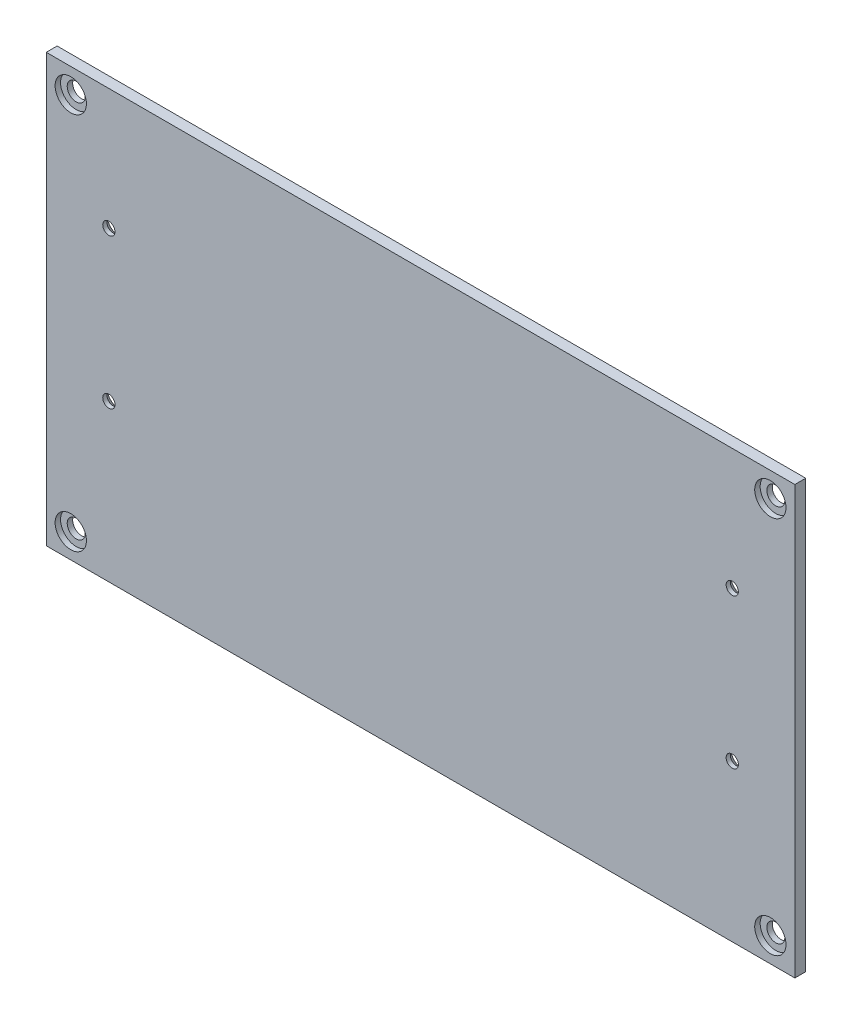
ISO-10303-21;
HEADER;
FILE_DESCRIPTION(('STEP AP214'),'2;1');
FILE_NAME('part.step','',(''),(''),'','','');
FILE_SCHEMA(('AUTOMOTIVE_DESIGN { 1 0 10303 214 1 1 1 1 }'));
ENDSEC;
DATA;
#1=APPLICATION_CONTEXT('core data for automotive mechanical design processes');
#2=APPLICATION_PROTOCOL_DEFINITION('international standard','automotive_design',2000,#1);
#3=PRODUCT_CONTEXT('',#1,'mechanical');
#4=PRODUCT('Part','Part','',(#3));
#5=PRODUCT_RELATED_PRODUCT_CATEGORY('part','',(#4));
#6=PRODUCT_DEFINITION_FORMATION('','',#4);
#7=PRODUCT_DEFINITION_CONTEXT('part definition',#1,'design');
#8=PRODUCT_DEFINITION('design','',#6,#7);
#9=PRODUCT_DEFINITION_SHAPE('','',#8);
#10=(LENGTH_UNIT() NAMED_UNIT(*) SI_UNIT(.MILLI.,.METRE.));
#11=(NAMED_UNIT(*) PLANE_ANGLE_UNIT() SI_UNIT($,.RADIAN.));
#12=(NAMED_UNIT(*) SI_UNIT($,.STERADIAN.) SOLID_ANGLE_UNIT());
#13=UNCERTAINTY_MEASURE_WITH_UNIT(LENGTH_MEASURE(1.E-05),#10,'distance_accuracy_value','');
#14=(GEOMETRIC_REPRESENTATION_CONTEXT(3) GLOBAL_UNCERTAINTY_ASSIGNED_CONTEXT((#13)) GLOBAL_UNIT_ASSIGNED_CONTEXT((#10,
#11,#12)) REPRESENTATION_CONTEXT('',''));
#15=CARTESIAN_POINT('',(0.,0.,0.));
#16=DIRECTION('',(0.,0.,1.));
#17=DIRECTION('',(1.,0.,0.));
#18=AXIS2_PLACEMENT_3D('',#15,#16,#17);
#19=CARTESIAN_POINT('',(-137.5,78.5,4.));
#20=DIRECTION('',(0.,-1.,0.));
#21=DIRECTION('',(0.,0.,-1.));
#22=AXIS2_PLACEMENT_3D('',#19,#20,#21);
#23=PLANE('',#22);
#24=DIRECTION('',(-1.,0.,0.));
#25=VECTOR('',#24,1.);
#26=CARTESIAN_POINT('',(-137.5,78.5,0.));
#27=LINE('',#26,#25);
#28=CARTESIAN_POINT('',(137.5,78.5,0.));
#29=VERTEX_POINT('',#28);
#30=CARTESIAN_POINT('',(-137.5,78.5,0.));
#31=VERTEX_POINT('',#30);
#32=EDGE_CURVE('E102',#29,#31,#27,.T.);
#33=ORIENTED_EDGE('',*,*,#32,.T.);
#34=DIRECTION('',(0.,0.,-1.));
#35=VECTOR('',#34,1.);
#36=CARTESIAN_POINT('',(-137.5,78.5,4.));
#37=LINE('',#36,#35);
#38=CARTESIAN_POINT('',(-137.5,78.5,4.));
#39=VERTEX_POINT('',#38);
#40=EDGE_CURVE('E11',#39,#31,#37,.T.);
#41=ORIENTED_EDGE('',*,*,#40,.F.);
#42=DIRECTION('',(-1.,0.,0.));
#43=VECTOR('',#42,1.);
#44=CARTESIAN_POINT('',(-137.5,78.5,4.));
#45=LINE('',#44,#43);
#46=CARTESIAN_POINT('',(137.5,78.5,4.));
#47=VERTEX_POINT('',#46);
#48=EDGE_CURVE('E90',#47,#39,#45,.T.);
#49=ORIENTED_EDGE('',*,*,#48,.F.);
#50=DIRECTION('',(0.,0.,-1.));
#51=VECTOR('',#50,1.);
#52=CARTESIAN_POINT('',(137.5,78.5,4.));
#53=LINE('',#52,#51);
#54=EDGE_CURVE('E98',#47,#29,#53,.T.);
#55=ORIENTED_EDGE('',*,*,#54,.T.);
#56=EDGE_LOOP('',(#33,#41,#49,#55));
#57=FACE_BOUND('',#56,.T.);
#58=ADVANCED_FACE('F39',(#57),#23,.F.);
#59=CARTESIAN_POINT('',(-137.5,78.5,4.));
#60=DIRECTION('',(1.,0.,0.));
#61=DIRECTION('',(0.,0.,-1.));
#62=AXIS2_PLACEMENT_3D('',#59,#60,#61);
#63=PLANE('',#62);
#64=DIRECTION('',(0.,-1.,0.));
#65=VECTOR('',#64,1.);
#66=CARTESIAN_POINT('',(-137.5,78.5,0.));
#67=LINE('',#66,#65);
#68=CARTESIAN_POINT('',(-137.5,-78.5,0.));
#69=VERTEX_POINT('',#68);
#70=EDGE_CURVE('E94',#31,#69,#67,.T.);
#71=ORIENTED_EDGE('',*,*,#70,.T.);
#72=DIRECTION('',(0.,0.,-1.));
#73=VECTOR('',#72,1.);
#74=CARTESIAN_POINT('',(-137.5,-78.5,4.));
#75=LINE('',#74,#73);
#76=CARTESIAN_POINT('',(-137.5,-78.5,4.));
#77=VERTEX_POINT('',#76);
#78=EDGE_CURVE('E47',#77,#69,#75,.T.);
#79=ORIENTED_EDGE('',*,*,#78,.F.);
#80=DIRECTION('',(0.,-1.,0.));
#81=VECTOR('',#80,1.);
#82=CARTESIAN_POINT('',(-137.5,78.5,4.));
#83=LINE('',#82,#81);
#84=EDGE_CURVE('E85',#39,#77,#83,.T.);
#85=ORIENTED_EDGE('',*,*,#84,.F.);
#86=ORIENTED_EDGE('',*,*,#40,.T.);
#87=EDGE_LOOP('',(#71,#79,#85,#86));
#88=FACE_BOUND('',#87,.T.);
#89=ADVANCED_FACE('F93',(#88),#63,.F.);
#90=CARTESIAN_POINT('',(-137.5,-78.5,4.));
#91=DIRECTION('',(0.,1.,0.));
#92=DIRECTION('',(0.,0.,1.));
#93=AXIS2_PLACEMENT_3D('',#90,#91,#92);
#94=PLANE('',#93);
#95=DIRECTION('',(1.,0.,0.));
#96=VECTOR('',#95,1.);
#97=CARTESIAN_POINT('',(-137.5,-78.5,0.));
#98=LINE('',#97,#96);
#99=CARTESIAN_POINT('',(137.5,-78.5,0.));
#100=VERTEX_POINT('',#99);
#101=EDGE_CURVE('E72',#69,#100,#98,.T.);
#102=ORIENTED_EDGE('',*,*,#101,.T.);
#103=DIRECTION('',(0.,0.,-1.));
#104=VECTOR('',#103,1.);
#105=CARTESIAN_POINT('',(137.5,-78.5,4.));
#106=LINE('',#105,#104);
#107=CARTESIAN_POINT('',(137.5,-78.5,4.));
#108=VERTEX_POINT('',#107);
#109=EDGE_CURVE('E95',#108,#100,#106,.T.);
#110=ORIENTED_EDGE('',*,*,#109,.F.);
#111=DIRECTION('',(1.,0.,0.));
#112=VECTOR('',#111,1.);
#113=CARTESIAN_POINT('',(-137.5,-78.5,4.));
#114=LINE('',#113,#112);
#115=EDGE_CURVE('E88',#77,#108,#114,.T.);
#116=ORIENTED_EDGE('',*,*,#115,.F.);
#117=ORIENTED_EDGE('',*,*,#78,.T.);
#118=EDGE_LOOP('',(#102,#110,#116,#117));
#119=FACE_BOUND('',#118,.T.);
#120=ADVANCED_FACE('F96',(#119),#94,.F.);
#121=CARTESIAN_POINT('',(137.5,78.5,4.));
#122=DIRECTION('',(-1.,0.,0.));
#123=DIRECTION('',(0.,0.,1.));
#124=AXIS2_PLACEMENT_3D('',#121,#122,#123);
#125=PLANE('',#124);
#126=DIRECTION('',(0.,1.,0.));
#127=VECTOR('',#126,1.);
#128=CARTESIAN_POINT('',(137.5,78.5,0.));
#129=LINE('',#128,#127);
#130=EDGE_CURVE('E78',#100,#29,#129,.T.);
#131=ORIENTED_EDGE('',*,*,#130,.T.);
#132=ORIENTED_EDGE('',*,*,#54,.F.);
#133=DIRECTION('',(0.,1.,0.));
#134=VECTOR('',#133,1.);
#135=CARTESIAN_POINT('',(137.5,78.5,4.));
#136=LINE('',#135,#134);
#137=EDGE_CURVE('E55',#108,#47,#136,.T.);
#138=ORIENTED_EDGE('',*,*,#137,.F.);
#139=ORIENTED_EDGE('',*,*,#109,.T.);
#140=EDGE_LOOP('',(#131,#132,#138,#139));
#141=FACE_BOUND('',#140,.T.);
#142=ADVANCED_FACE('F110',(#141),#125,.F.);
#143=CARTESIAN_POINT('',(0.,0.,4.));
#144=DIRECTION('',(0.,0.,-1.));
#145=DIRECTION('',(-1.,0.,0.));
#146=AXIS2_PLACEMENT_3D('',#143,#144,#145);
#147=PLANE('',#146);
#148=CARTESIAN_POINT('',(-128.5,-69.5,4.));
#149=DIRECTION('',(0.,0.,1.));
#150=DIRECTION('',(1.,0.,0.));
#151=AXIS2_PLACEMENT_3D('',#148,#149,#150);
#152=CIRCLE('',#151,5.75000000000001);
#153=CARTESIAN_POINT('',(-122.75,-69.5,4.));
#154=VERTEX_POINT('',#153);
#155=EDGE_CURVE('E196',#154,#154,#152,.T.);
#156=ORIENTED_EDGE('',*,*,#155,.F.);
#157=EDGE_LOOP('',(#156));
#158=FACE_BOUND('',#157,.T.);
#159=CARTESIAN_POINT('',(-128.5,69.5,4.));
#160=DIRECTION('',(0.,0.,1.));
#161=DIRECTION('',(1.,0.,0.));
#162=AXIS2_PLACEMENT_3D('',#159,#160,#161);
#163=CIRCLE('',#162,5.75000000000001);
#164=CARTESIAN_POINT('',(-122.75,69.5,4.));
#165=VERTEX_POINT('',#164);
#166=EDGE_CURVE('E184',#165,#165,#163,.T.);
#167=ORIENTED_EDGE('',*,*,#166,.F.);
#168=EDGE_LOOP('',(#167));
#169=FACE_BOUND('',#168,.T.);
#170=CARTESIAN_POINT('',(128.5,69.5,4.));
#171=DIRECTION('',(0.,0.,1.));
#172=DIRECTION('',(1.,0.,0.));
#173=AXIS2_PLACEMENT_3D('',#170,#171,#172);
#174=CIRCLE('',#173,5.75000000000001);
#175=CARTESIAN_POINT('',(134.25,69.5,4.));
#176=VERTEX_POINT('',#175);
#177=EDGE_CURVE('E172',#176,#176,#174,.T.);
#178=ORIENTED_EDGE('',*,*,#177,.F.);
#179=EDGE_LOOP('',(#178));
#180=FACE_BOUND('',#179,.T.);
#181=CARTESIAN_POINT('',(128.5,-69.5,4.));
#182=DIRECTION('',(0.,0.,1.));
#183=DIRECTION('',(1.,0.,0.));
#184=AXIS2_PLACEMENT_3D('',#181,#182,#183);
#185=CIRCLE('',#184,5.75000000000001);
#186=CARTESIAN_POINT('',(134.25,-69.5,4.));
#187=VERTEX_POINT('',#186);
#188=EDGE_CURVE('E160',#187,#187,#185,.T.);
#189=ORIENTED_EDGE('',*,*,#188,.F.);
#190=EDGE_LOOP('',(#189));
#191=FACE_BOUND('',#190,.T.);
#192=CARTESIAN_POINT('',(114.5,34.,4.));
#193=DIRECTION('',(0.,0.,-1.));
#194=DIRECTION('',(-1.,0.,0.));
#195=AXIS2_PLACEMENT_3D('',#192,#193,#194);
#196=CIRCLE('',#195,2.25);
#197=CARTESIAN_POINT('',(112.25,34.,4.));
#198=VERTEX_POINT('',#197);
#199=EDGE_CURVE('E142',#198,#198,#196,.T.);
#200=ORIENTED_EDGE('',*,*,#199,.T.);
#201=EDGE_LOOP('',(#200));
#202=FACE_BOUND('',#201,.T.);
#203=CARTESIAN_POINT('',(114.5,-21.,4.));
#204=DIRECTION('',(0.,0.,-1.));
#205=DIRECTION('',(-1.,0.,0.));
#206=AXIS2_PLACEMENT_3D('',#203,#204,#205);
#207=CIRCLE('',#206,2.25);
#208=CARTESIAN_POINT('',(112.25,-21.,4.));
#209=VERTEX_POINT('',#208);
#210=EDGE_CURVE('E133',#209,#209,#207,.T.);
#211=ORIENTED_EDGE('',*,*,#210,.T.);
#212=EDGE_LOOP('',(#211));
#213=FACE_BOUND('',#212,.T.);
#214=CARTESIAN_POINT('',(-114.5,34.,4.));
#215=DIRECTION('',(0.,0.,-1.));
#216=DIRECTION('',(-1.,0.,0.));
#217=AXIS2_PLACEMENT_3D('',#214,#215,#216);
#218=CIRCLE('',#217,2.25);
#219=CARTESIAN_POINT('',(-116.75,34.,4.));
#220=VERTEX_POINT('',#219);
#221=EDGE_CURVE('E124',#220,#220,#218,.T.);
#222=ORIENTED_EDGE('',*,*,#221,.T.);
#223=EDGE_LOOP('',(#222));
#224=FACE_BOUND('',#223,.T.);
#225=CARTESIAN_POINT('',(-114.5,-21.,4.));
#226=DIRECTION('',(0.,0.,-1.));
#227=DIRECTION('',(-1.,0.,0.));
#228=AXIS2_PLACEMENT_3D('',#225,#226,#227);
#229=CIRCLE('',#228,2.25);
#230=CARTESIAN_POINT('',(-116.75,-21.,4.));
#231=VERTEX_POINT('',#230);
#232=EDGE_CURVE('E105',#231,#231,#229,.T.);
#233=ORIENTED_EDGE('',*,*,#232,.T.);
#234=EDGE_LOOP('',(#233));
#235=FACE_BOUND('',#234,.T.);
#236=ORIENTED_EDGE('',*,*,#48,.T.);
#237=ORIENTED_EDGE('',*,*,#84,.T.);
#238=ORIENTED_EDGE('',*,*,#115,.T.);
#239=ORIENTED_EDGE('',*,*,#137,.T.);
#240=EDGE_LOOP('',(#236,#237,#238,#239));
#241=FACE_BOUND('',#240,.T.);
#242=ADVANCED_FACE('F86',(#158,#169,#180,#191,#202,#213,#224,#235,#241),#147,.F.);
#243=CARTESIAN_POINT('',(0.,0.,0.));
#244=DIRECTION('',(0.,0.,-1.));
#245=DIRECTION('',(-1.,0.,0.));
#246=AXIS2_PLACEMENT_3D('',#243,#244,#245);
#247=PLANE('',#246);
#248=CARTESIAN_POINT('',(-128.5,-69.5,0.));
#249=DIRECTION('',(0.,0.,1.));
#250=DIRECTION('',(1.,0.,0.));
#251=AXIS2_PLACEMENT_3D('',#248,#249,#250);
#252=CIRCLE('',#251,3.3);
#253=CARTESIAN_POINT('',(-125.2,-69.5,0.));
#254=VERTEX_POINT('',#253);
#255=EDGE_CURVE('E187',#254,#254,#252,.T.);
#256=ORIENTED_EDGE('',*,*,#255,.T.);
#257=EDGE_LOOP('',(#256));
#258=FACE_BOUND('',#257,.T.);
#259=CARTESIAN_POINT('',(-128.5,69.5,0.));
#260=DIRECTION('',(0.,0.,1.));
#261=DIRECTION('',(1.,0.,0.));
#262=AXIS2_PLACEMENT_3D('',#259,#260,#261);
#263=CIRCLE('',#262,3.3);
#264=CARTESIAN_POINT('',(-125.2,69.5,0.));
#265=VERTEX_POINT('',#264);
#266=EDGE_CURVE('E175',#265,#265,#263,.T.);
#267=ORIENTED_EDGE('',*,*,#266,.T.);
#268=EDGE_LOOP('',(#267));
#269=FACE_BOUND('',#268,.T.);
#270=CARTESIAN_POINT('',(128.5,69.5,0.));
#271=DIRECTION('',(0.,0.,1.));
#272=DIRECTION('',(1.,0.,0.));
#273=AXIS2_PLACEMENT_3D('',#270,#271,#272);
#274=CIRCLE('',#273,3.3);
#275=CARTESIAN_POINT('',(131.8,69.5,0.));
#276=VERTEX_POINT('',#275);
#277=EDGE_CURVE('E163',#276,#276,#274,.T.);
#278=ORIENTED_EDGE('',*,*,#277,.T.);
#279=EDGE_LOOP('',(#278));
#280=FACE_BOUND('',#279,.T.);
#281=CARTESIAN_POINT('',(128.5,-69.5,0.));
#282=DIRECTION('',(0.,0.,1.));
#283=DIRECTION('',(1.,0.,0.));
#284=AXIS2_PLACEMENT_3D('',#281,#282,#283);
#285=CIRCLE('',#284,3.3);
#286=CARTESIAN_POINT('',(131.8,-69.5,0.));
#287=VERTEX_POINT('',#286);
#288=EDGE_CURVE('E151',#287,#287,#285,.T.);
#289=ORIENTED_EDGE('',*,*,#288,.T.);
#290=EDGE_LOOP('',(#289));
#291=FACE_BOUND('',#290,.T.);
#292=CARTESIAN_POINT('',(114.5,34.,0.));
#293=DIRECTION('',(0.,0.,-1.));
#294=DIRECTION('',(-1.,0.,0.));
#295=AXIS2_PLACEMENT_3D('',#292,#293,#294);
#296=CIRCLE('',#295,4.7);
#297=CARTESIAN_POINT('',(109.8,34.,0.));
#298=VERTEX_POINT('',#297);
#299=EDGE_CURVE('E148',#298,#298,#296,.T.);
#300=ORIENTED_EDGE('',*,*,#299,.F.);
#301=EDGE_LOOP('',(#300));
#302=FACE_BOUND('',#301,.T.);
#303=CARTESIAN_POINT('',(114.5,-21.,0.));
#304=DIRECTION('',(0.,0.,-1.));
#305=DIRECTION('',(-1.,0.,0.));
#306=AXIS2_PLACEMENT_3D('',#303,#304,#305);
#307=CIRCLE('',#306,4.7);
#308=CARTESIAN_POINT('',(109.8,-21.,0.));
#309=VERTEX_POINT('',#308);
#310=EDGE_CURVE('E139',#309,#309,#307,.T.);
#311=ORIENTED_EDGE('',*,*,#310,.F.);
#312=EDGE_LOOP('',(#311));
#313=FACE_BOUND('',#312,.T.);
#314=CARTESIAN_POINT('',(-114.5,34.,0.));
#315=DIRECTION('',(0.,0.,-1.));
#316=DIRECTION('',(-1.,0.,0.));
#317=AXIS2_PLACEMENT_3D('',#314,#315,#316);
#318=CIRCLE('',#317,4.7);
#319=CARTESIAN_POINT('',(-119.2,34.,0.));
#320=VERTEX_POINT('',#319);
#321=EDGE_CURVE('E130',#320,#320,#318,.T.);
#322=ORIENTED_EDGE('',*,*,#321,.F.);
#323=EDGE_LOOP('',(#322));
#324=FACE_BOUND('',#323,.T.);
#325=CARTESIAN_POINT('',(-114.5,-21.,0.));
#326=DIRECTION('',(0.,0.,-1.));
#327=DIRECTION('',(-1.,0.,0.));
#328=AXIS2_PLACEMENT_3D('',#325,#326,#327);
#329=CIRCLE('',#328,4.7);
#330=CARTESIAN_POINT('',(-119.2,-21.,0.));
#331=VERTEX_POINT('',#330);
#332=EDGE_CURVE('E121',#331,#331,#329,.T.);
#333=ORIENTED_EDGE('',*,*,#332,.F.);
#334=EDGE_LOOP('',(#333));
#335=FACE_BOUND('',#334,.T.);
#336=ORIENTED_EDGE('',*,*,#32,.F.);
#337=ORIENTED_EDGE('',*,*,#130,.F.);
#338=ORIENTED_EDGE('',*,*,#101,.F.);
#339=ORIENTED_EDGE('',*,*,#70,.F.);
#340=EDGE_LOOP('',(#336,#337,#338,#339));
#341=FACE_BOUND('',#340,.T.);
#342=ADVANCED_FACE('F113',(#258,#269,#280,#291,#302,#313,#324,#335,#341),#247,.T.);
#343=CARTESIAN_POINT('',(-114.5,-21.,0.));
#344=DIRECTION('',(0.,0.,-1.));
#345=DIRECTION('',(-1.,0.,0.));
#346=AXIS2_PLACEMENT_3D('',#343,#344,#345);
#347=CYLINDRICAL_SURFACE('',#346,2.25);
#348=ORIENTED_EDGE('',*,*,#232,.F.);
#349=EDGE_LOOP('',(#348));
#350=FACE_BOUND('',#349,.T.);
#351=CARTESIAN_POINT('',(-114.5,-21.,2.45));
#352=DIRECTION('',(0.,0.,-1.));
#353=DIRECTION('',(-1.,0.,0.));
#354=AXIS2_PLACEMENT_3D('',#351,#352,#353);
#355=CIRCLE('',#354,2.25);
#356=CARTESIAN_POINT('',(-116.75,-21.,2.45));
#357=VERTEX_POINT('',#356);
#358=EDGE_CURVE('E118',#357,#357,#355,.T.);
#359=ORIENTED_EDGE('',*,*,#358,.T.);
#360=EDGE_LOOP('',(#359));
#361=FACE_BOUND('',#360,.T.);
#362=ADVANCED_FACE('F219',(#350,#361),#347,.F.);
#363=CARTESIAN_POINT('',(-114.5,-21.,0.));
#364=DIRECTION('',(0.,0.,-1.));
#365=DIRECTION('',(-1.,0.,0.));
#366=AXIS2_PLACEMENT_3D('',#363,#364,#365);
#367=CONICAL_SURFACE('',#366,4.7,0.785398163397447);
#368=ORIENTED_EDGE('',*,*,#358,.F.);
#369=EDGE_LOOP('',(#368));
#370=FACE_BOUND('',#369,.T.);
#371=ORIENTED_EDGE('',*,*,#332,.T.);
#372=EDGE_LOOP('',(#371));
#373=FACE_BOUND('',#372,.T.);
#374=ADVANCED_FACE('F222',(#370,#373),#367,.F.);
#375=CARTESIAN_POINT('',(-114.5,34.,0.));
#376=DIRECTION('',(0.,0.,-1.));
#377=DIRECTION('',(-1.,0.,0.));
#378=AXIS2_PLACEMENT_3D('',#375,#376,#377);
#379=CYLINDRICAL_SURFACE('',#378,2.25);
#380=ORIENTED_EDGE('',*,*,#221,.F.);
#381=EDGE_LOOP('',(#380));
#382=FACE_BOUND('',#381,.T.);
#383=CARTESIAN_POINT('',(-114.5,34.,2.45));
#384=DIRECTION('',(0.,0.,-1.));
#385=DIRECTION('',(-1.,0.,0.));
#386=AXIS2_PLACEMENT_3D('',#383,#384,#385);
#387=CIRCLE('',#386,2.25);
#388=CARTESIAN_POINT('',(-116.75,34.,2.45));
#389=VERTEX_POINT('',#388);
#390=EDGE_CURVE('E127',#389,#389,#387,.T.);
#391=ORIENTED_EDGE('',*,*,#390,.T.);
#392=EDGE_LOOP('',(#391));
#393=FACE_BOUND('',#392,.T.);
#394=ADVANCED_FACE('F228',(#382,#393),#379,.F.);
#395=CARTESIAN_POINT('',(-114.5,34.,0.));
#396=DIRECTION('',(0.,0.,-1.));
#397=DIRECTION('',(-1.,0.,0.));
#398=AXIS2_PLACEMENT_3D('',#395,#396,#397);
#399=CONICAL_SURFACE('',#398,4.7,0.785398163397447);
#400=ORIENTED_EDGE('',*,*,#390,.F.);
#401=EDGE_LOOP('',(#400));
#402=FACE_BOUND('',#401,.T.);
#403=ORIENTED_EDGE('',*,*,#321,.T.);
#404=EDGE_LOOP('',(#403));
#405=FACE_BOUND('',#404,.T.);
#406=ADVANCED_FACE('F271',(#402,#405),#399,.F.);
#407=CARTESIAN_POINT('',(114.5,-21.,0.));
#408=DIRECTION('',(0.,0.,-1.));
#409=DIRECTION('',(-1.,0.,0.));
#410=AXIS2_PLACEMENT_3D('',#407,#408,#409);
#411=CYLINDRICAL_SURFACE('',#410,2.25);
#412=ORIENTED_EDGE('',*,*,#210,.F.);
#413=EDGE_LOOP('',(#412));
#414=FACE_BOUND('',#413,.T.);
#415=CARTESIAN_POINT('',(114.5,-21.,2.45));
#416=DIRECTION('',(0.,0.,-1.));
#417=DIRECTION('',(-1.,0.,0.));
#418=AXIS2_PLACEMENT_3D('',#415,#416,#417);
#419=CIRCLE('',#418,2.25);
#420=CARTESIAN_POINT('',(112.25,-21.,2.45));
#421=VERTEX_POINT('',#420);
#422=EDGE_CURVE('E136',#421,#421,#419,.T.);
#423=ORIENTED_EDGE('',*,*,#422,.T.);
#424=EDGE_LOOP('',(#423));
#425=FACE_BOUND('',#424,.T.);
#426=ADVANCED_FACE('F280',(#414,#425),#411,.F.);
#427=CARTESIAN_POINT('',(114.5,-21.,0.));
#428=DIRECTION('',(0.,0.,-1.));
#429=DIRECTION('',(-1.,0.,0.));
#430=AXIS2_PLACEMENT_3D('',#427,#428,#429);
#431=CONICAL_SURFACE('',#430,4.7,0.785398163397447);
#432=ORIENTED_EDGE('',*,*,#422,.F.);
#433=EDGE_LOOP('',(#432));
#434=FACE_BOUND('',#433,.T.);
#435=ORIENTED_EDGE('',*,*,#310,.T.);
#436=EDGE_LOOP('',(#435));
#437=FACE_BOUND('',#436,.T.);
#438=ADVANCED_FACE('F289',(#434,#437),#431,.F.);
#439=CARTESIAN_POINT('',(114.5,34.,0.));
#440=DIRECTION('',(0.,0.,-1.));
#441=DIRECTION('',(-1.,0.,0.));
#442=AXIS2_PLACEMENT_3D('',#439,#440,#441);
#443=CYLINDRICAL_SURFACE('',#442,2.25);
#444=ORIENTED_EDGE('',*,*,#199,.F.);
#445=EDGE_LOOP('',(#444));
#446=FACE_BOUND('',#445,.T.);
#447=CARTESIAN_POINT('',(114.5,34.,2.45));
#448=DIRECTION('',(0.,0.,-1.));
#449=DIRECTION('',(-1.,0.,0.));
#450=AXIS2_PLACEMENT_3D('',#447,#448,#449);
#451=CIRCLE('',#450,2.25);
#452=CARTESIAN_POINT('',(112.25,34.,2.45));
#453=VERTEX_POINT('',#452);
#454=EDGE_CURVE('E145',#453,#453,#451,.T.);
#455=ORIENTED_EDGE('',*,*,#454,.T.);
#456=EDGE_LOOP('',(#455));
#457=FACE_BOUND('',#456,.T.);
#458=ADVANCED_FACE('F298',(#446,#457),#443,.F.);
#459=CARTESIAN_POINT('',(114.5,34.,0.));
#460=DIRECTION('',(0.,0.,-1.));
#461=DIRECTION('',(-1.,0.,0.));
#462=AXIS2_PLACEMENT_3D('',#459,#460,#461);
#463=CONICAL_SURFACE('',#462,4.7,0.785398163397447);
#464=ORIENTED_EDGE('',*,*,#454,.F.);
#465=EDGE_LOOP('',(#464));
#466=FACE_BOUND('',#465,.T.);
#467=ORIENTED_EDGE('',*,*,#299,.T.);
#468=EDGE_LOOP('',(#467));
#469=FACE_BOUND('',#468,.T.);
#470=ADVANCED_FACE('F307',(#466,#469),#463,.F.);
#471=CARTESIAN_POINT('',(128.5,-69.5,4.));
#472=DIRECTION('',(0.,0.,1.));
#473=DIRECTION('',(1.,0.,0.));
#474=AXIS2_PLACEMENT_3D('',#471,#472,#473);
#475=CYLINDRICAL_SURFACE('',#474,3.3);
#476=ORIENTED_EDGE('',*,*,#288,.F.);
#477=EDGE_LOOP('',(#476));
#478=FACE_BOUND('',#477,.T.);
#479=CARTESIAN_POINT('',(128.5,-69.5,2.));
#480=DIRECTION('',(0.,0.,1.));
#481=DIRECTION('',(1.,0.,0.));
#482=AXIS2_PLACEMENT_3D('',#479,#480,#481);
#483=CIRCLE('',#482,3.3);
#484=CARTESIAN_POINT('',(131.8,-69.5,2.));
#485=VERTEX_POINT('',#484);
#486=EDGE_CURVE('E154',#485,#485,#483,.T.);
#487=ORIENTED_EDGE('',*,*,#486,.T.);
#488=EDGE_LOOP('',(#487));
#489=FACE_BOUND('',#488,.T.);
#490=ADVANCED_FACE('F315',(#478,#489),#475,.F.);
#491=CARTESIAN_POINT('',(131.8,-69.5,2.));
#492=DIRECTION('',(0.,0.,-1.));
#493=DIRECTION('',(-1.,0.,0.));
#494=AXIS2_PLACEMENT_3D('',#491,#492,#493);
#495=PLANE('',#494);
#496=ORIENTED_EDGE('',*,*,#486,.F.);
#497=EDGE_LOOP('',(#496));
#498=FACE_BOUND('',#497,.T.);
#499=CARTESIAN_POINT('',(128.5,-69.5,2.));
#500=DIRECTION('',(0.,0.,1.));
#501=DIRECTION('',(1.,0.,0.));
#502=AXIS2_PLACEMENT_3D('',#499,#500,#501);
#503=CIRCLE('',#502,5.75000000000001);
#504=CARTESIAN_POINT('',(134.25,-69.5,2.));
#505=VERTEX_POINT('',#504);
#506=EDGE_CURVE('E157',#505,#505,#503,.T.);
#507=ORIENTED_EDGE('',*,*,#506,.T.);
#508=EDGE_LOOP('',(#507));
#509=FACE_BOUND('',#508,.T.);
#510=ADVANCED_FACE('F342',(#498,#509),#495,.F.);
#511=CARTESIAN_POINT('',(128.5,-69.5,4.));
#512=DIRECTION('',(0.,0.,1.));
#513=DIRECTION('',(1.,0.,0.));
#514=AXIS2_PLACEMENT_3D('',#511,#512,#513);
#515=CYLINDRICAL_SURFACE('',#514,5.75000000000001);
#516=ORIENTED_EDGE('',*,*,#506,.F.);
#517=EDGE_LOOP('',(#516));
#518=FACE_BOUND('',#517,.T.);
#519=ORIENTED_EDGE('',*,*,#188,.T.);
#520=EDGE_LOOP('',(#519));
#521=FACE_BOUND('',#520,.T.);
#522=ADVANCED_FACE('F351',(#518,#521),#515,.F.);
#523=CARTESIAN_POINT('',(128.5,69.5,4.));
#524=DIRECTION('',(0.,0.,1.));
#525=DIRECTION('',(1.,0.,0.));
#526=AXIS2_PLACEMENT_3D('',#523,#524,#525);
#527=CYLINDRICAL_SURFACE('',#526,3.3);
#528=ORIENTED_EDGE('',*,*,#277,.F.);
#529=EDGE_LOOP('',(#528));
#530=FACE_BOUND('',#529,.T.);
#531=CARTESIAN_POINT('',(128.5,69.5,2.));
#532=DIRECTION('',(0.,0.,1.));
#533=DIRECTION('',(1.,0.,0.));
#534=AXIS2_PLACEMENT_3D('',#531,#532,#533);
#535=CIRCLE('',#534,3.3);
#536=CARTESIAN_POINT('',(131.8,69.5,2.));
#537=VERTEX_POINT('',#536);
#538=EDGE_CURVE('E166',#537,#537,#535,.T.);
#539=ORIENTED_EDGE('',*,*,#538,.T.);
#540=EDGE_LOOP('',(#539));
#541=FACE_BOUND('',#540,.T.);
#542=ADVANCED_FACE('F360',(#530,#541),#527,.F.);
#543=CARTESIAN_POINT('',(131.8,69.5,2.));
#544=DIRECTION('',(0.,0.,-1.));
#545=DIRECTION('',(-1.,0.,0.));
#546=AXIS2_PLACEMENT_3D('',#543,#544,#545);
#547=PLANE('',#546);
#548=ORIENTED_EDGE('',*,*,#538,.F.);
#549=EDGE_LOOP('',(#548));
#550=FACE_BOUND('',#549,.T.);
#551=CARTESIAN_POINT('',(128.5,69.5,2.));
#552=DIRECTION('',(0.,0.,1.));
#553=DIRECTION('',(1.,0.,0.));
#554=AXIS2_PLACEMENT_3D('',#551,#552,#553);
#555=CIRCLE('',#554,5.75000000000001);
#556=CARTESIAN_POINT('',(134.25,69.5,2.));
#557=VERTEX_POINT('',#556);
#558=EDGE_CURVE('E169',#557,#557,#555,.T.);
#559=ORIENTED_EDGE('',*,*,#558,.T.);
#560=EDGE_LOOP('',(#559));
#561=FACE_BOUND('',#560,.T.);
#562=ADVANCED_FACE('F369',(#550,#561),#547,.F.);
#563=CARTESIAN_POINT('',(128.5,69.5,4.));
#564=DIRECTION('',(0.,0.,1.));
#565=DIRECTION('',(1.,0.,0.));
#566=AXIS2_PLACEMENT_3D('',#563,#564,#565);
#567=CYLINDRICAL_SURFACE('',#566,5.75000000000001);
#568=ORIENTED_EDGE('',*,*,#558,.F.);
#569=EDGE_LOOP('',(#568));
#570=FACE_BOUND('',#569,.T.);
#571=ORIENTED_EDGE('',*,*,#177,.T.);
#572=EDGE_LOOP('',(#571));
#573=FACE_BOUND('',#572,.T.);
#574=ADVANCED_FACE('F378',(#570,#573),#567,.F.);
#575=CARTESIAN_POINT('',(-128.5,69.5,4.));
#576=DIRECTION('',(0.,0.,1.));
#577=DIRECTION('',(1.,0.,0.));
#578=AXIS2_PLACEMENT_3D('',#575,#576,#577);
#579=CYLINDRICAL_SURFACE('',#578,3.3);
#580=ORIENTED_EDGE('',*,*,#266,.F.);
#581=EDGE_LOOP('',(#580));
#582=FACE_BOUND('',#581,.T.);
#583=CARTESIAN_POINT('',(-128.5,69.5,2.));
#584=DIRECTION('',(0.,0.,1.));
#585=DIRECTION('',(1.,0.,0.));
#586=AXIS2_PLACEMENT_3D('',#583,#584,#585);
#587=CIRCLE('',#586,3.3);
#588=CARTESIAN_POINT('',(-125.2,69.5,2.));
#589=VERTEX_POINT('',#588);
#590=EDGE_CURVE('E178',#589,#589,#587,.T.);
#591=ORIENTED_EDGE('',*,*,#590,.T.);
#592=EDGE_LOOP('',(#591));
#593=FACE_BOUND('',#592,.T.);
#594=ADVANCED_FACE('F387',(#582,#593),#579,.F.);
#595=CARTESIAN_POINT('',(-125.2,69.5,2.));
#596=DIRECTION('',(0.,0.,-1.));
#597=DIRECTION('',(-1.,0.,0.));
#598=AXIS2_PLACEMENT_3D('',#595,#596,#597);
#599=PLANE('',#598);
#600=ORIENTED_EDGE('',*,*,#590,.F.);
#601=EDGE_LOOP('',(#600));
#602=FACE_BOUND('',#601,.T.);
#603=CARTESIAN_POINT('',(-128.5,69.5,2.));
#604=DIRECTION('',(0.,0.,1.));
#605=DIRECTION('',(1.,0.,0.));
#606=AXIS2_PLACEMENT_3D('',#603,#604,#605);
#607=CIRCLE('',#606,5.75000000000001);
#608=CARTESIAN_POINT('',(-122.75,69.5,2.));
#609=VERTEX_POINT('',#608);
#610=EDGE_CURVE('E181',#609,#609,#607,.T.);
#611=ORIENTED_EDGE('',*,*,#610,.T.);
#612=EDGE_LOOP('',(#611));
#613=FACE_BOUND('',#612,.T.);
#614=ADVANCED_FACE('F396',(#602,#613),#599,.F.);
#615=CARTESIAN_POINT('',(-128.5,69.5,4.));
#616=DIRECTION('',(0.,0.,1.));
#617=DIRECTION('',(1.,0.,0.));
#618=AXIS2_PLACEMENT_3D('',#615,#616,#617);
#619=CYLINDRICAL_SURFACE('',#618,5.75000000000001);
#620=ORIENTED_EDGE('',*,*,#610,.F.);
#621=EDGE_LOOP('',(#620));
#622=FACE_BOUND('',#621,.T.);
#623=ORIENTED_EDGE('',*,*,#166,.T.);
#624=EDGE_LOOP('',(#623));
#625=FACE_BOUND('',#624,.T.);
#626=ADVANCED_FACE('F405',(#622,#625),#619,.F.);
#627=CARTESIAN_POINT('',(-128.5,-69.5,4.));
#628=DIRECTION('',(0.,0.,1.));
#629=DIRECTION('',(1.,0.,0.));
#630=AXIS2_PLACEMENT_3D('',#627,#628,#629);
#631=CYLINDRICAL_SURFACE('',#630,3.3);
#632=ORIENTED_EDGE('',*,*,#255,.F.);
#633=EDGE_LOOP('',(#632));
#634=FACE_BOUND('',#633,.T.);
#635=CARTESIAN_POINT('',(-128.5,-69.5,2.));
#636=DIRECTION('',(0.,0.,1.));
#637=DIRECTION('',(1.,0.,0.));
#638=AXIS2_PLACEMENT_3D('',#635,#636,#637);
#639=CIRCLE('',#638,3.3);
#640=CARTESIAN_POINT('',(-125.2,-69.5,2.));
#641=VERTEX_POINT('',#640);
#642=EDGE_CURVE('E190',#641,#641,#639,.T.);
#643=ORIENTED_EDGE('',*,*,#642,.T.);
#644=EDGE_LOOP('',(#643));
#645=FACE_BOUND('',#644,.T.);
#646=ADVANCED_FACE('F414',(#634,#645),#631,.F.);
#647=CARTESIAN_POINT('',(-125.2,-69.5,2.));
#648=DIRECTION('',(0.,0.,-1.));
#649=DIRECTION('',(-1.,0.,0.));
#650=AXIS2_PLACEMENT_3D('',#647,#648,#649);
#651=PLANE('',#650);
#652=ORIENTED_EDGE('',*,*,#642,.F.);
#653=EDGE_LOOP('',(#652));
#654=FACE_BOUND('',#653,.T.);
#655=CARTESIAN_POINT('',(-128.5,-69.5,2.));
#656=DIRECTION('',(0.,0.,1.));
#657=DIRECTION('',(1.,0.,0.));
#658=AXIS2_PLACEMENT_3D('',#655,#656,#657);
#659=CIRCLE('',#658,5.75000000000001);
#660=CARTESIAN_POINT('',(-122.75,-69.5,2.));
#661=VERTEX_POINT('',#660);
#662=EDGE_CURVE('E193',#661,#661,#659,.T.);
#663=ORIENTED_EDGE('',*,*,#662,.T.);
#664=EDGE_LOOP('',(#663));
#665=FACE_BOUND('',#664,.T.);
#666=ADVANCED_FACE('F423',(#654,#665),#651,.F.);
#667=CARTESIAN_POINT('',(-128.5,-69.5,4.));
#668=DIRECTION('',(0.,0.,1.));
#669=DIRECTION('',(1.,0.,0.));
#670=AXIS2_PLACEMENT_3D('',#667,#668,#669);
#671=CYLINDRICAL_SURFACE('',#670,5.75000000000001);
#672=ORIENTED_EDGE('',*,*,#662,.F.);
#673=EDGE_LOOP('',(#672));
#674=FACE_BOUND('',#673,.T.);
#675=ORIENTED_EDGE('',*,*,#155,.T.);
#676=EDGE_LOOP('',(#675));
#677=FACE_BOUND('',#676,.T.);
#678=ADVANCED_FACE('F200',(#674,#677),#671,.F.);
#679=CLOSED_SHELL('',(#58,#89,#120,#142,#242,#342,#362,#374,#394,#406,#426,#438,#458,#470,#490,
#510,#522,#542,#562,#574,#594,#614,#626,#646,#666,#678));
#680=MANIFOLD_SOLID_BREP('B2',#679);
#681=ADVANCED_BREP_SHAPE_REPRESENTATION('',(#18,#680),#14);
#682=SHAPE_DEFINITION_REPRESENTATION(#9,#681);
ENDSEC;
END-ISO-10303-21;
